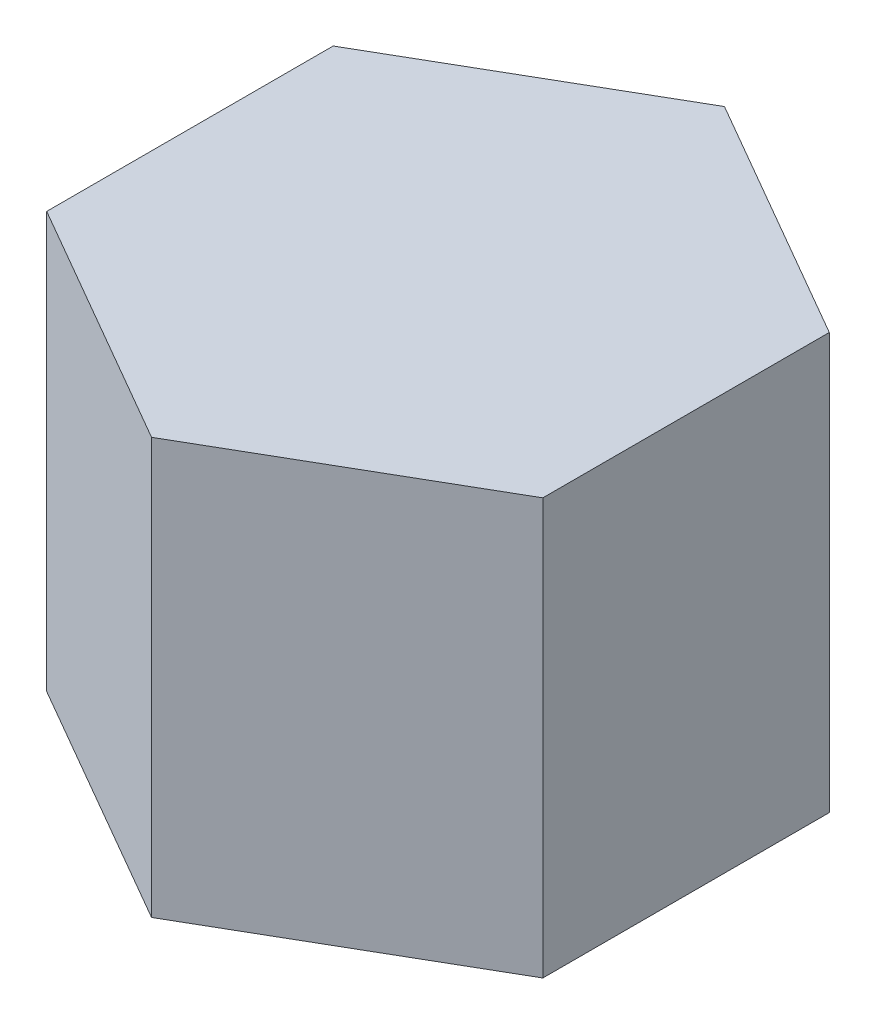
ISO-10303-21;
HEADER;
FILE_DESCRIPTION(('STEP AP214'),'2;1');
FILE_NAME('part.step','',(''),(''),'','','');
FILE_SCHEMA(('AUTOMOTIVE_DESIGN { 1 0 10303 214 1 1 1 1 }'));
ENDSEC;
DATA;
#1=APPLICATION_CONTEXT('core data for automotive mechanical design processes');
#2=APPLICATION_PROTOCOL_DEFINITION('international standard','automotive_design',2000,#1);
#3=PRODUCT_CONTEXT('',#1,'mechanical');
#4=PRODUCT('Part','Part','',(#3));
#5=PRODUCT_RELATED_PRODUCT_CATEGORY('part','',(#4));
#6=PRODUCT_DEFINITION_FORMATION('','',#4);
#7=PRODUCT_DEFINITION_CONTEXT('part definition',#1,'design');
#8=PRODUCT_DEFINITION('design','',#6,#7);
#9=PRODUCT_DEFINITION_SHAPE('','',#8);
#10=(LENGTH_UNIT() NAMED_UNIT(*) SI_UNIT(.MILLI.,.METRE.));
#11=(NAMED_UNIT(*) PLANE_ANGLE_UNIT() SI_UNIT($,.RADIAN.));
#12=(NAMED_UNIT(*) SI_UNIT($,.STERADIAN.) SOLID_ANGLE_UNIT());
#13=UNCERTAINTY_MEASURE_WITH_UNIT(LENGTH_MEASURE(1.E-05),#10,'distance_accuracy_value','');
#14=(GEOMETRIC_REPRESENTATION_CONTEXT(3) GLOBAL_UNCERTAINTY_ASSIGNED_CONTEXT((#13)) GLOBAL_UNIT_ASSIGNED_CONTEXT((#10,
#11,#12)) REPRESENTATION_CONTEXT('',''));
#15=CARTESIAN_POINT('',(0.,0.,0.));
#16=DIRECTION('',(0.,0.,1.));
#17=DIRECTION('',(1.,0.,0.));
#18=AXIS2_PLACEMENT_3D('',#15,#16,#17);
#19=CARTESIAN_POINT('',(206.642660308706,-148.537700895744,294.971072835632));
#20=DIRECTION('',(-0.499999999999909,0.,-0.866025403784491));
#21=DIRECTION('',(-0.866025403784491,0.,0.499999999999909));
#22=AXIS2_PLACEMENT_3D('',#19,#20,#21);
#23=PLANE('',#22);
#24=CARTESIAN_POINT('',(206.339551417381,-149.045793579175,295.146072835632));
#25=DIRECTION('',(0.866025403784491,0.,-0.499999999999909));
#26=VECTOR('',#25,1.);
#27=LINE('',#24,#26);
#28=CARTESIAN_POINT('',(206.339551417382,-149.045793579175,295.146072835632));
#29=VERTEX_POINT('',#28);
#30=CARTESIAN_POINT('',(206.642660308706,-149.045793579175,294.971072835632));
#31=VERTEX_POINT('',#30);
#32=EDGE_CURVE('E170',#29,#31,#27,.T.);
#33=ORIENTED_EDGE('',*,*,#32,.T.);
#34=CARTESIAN_POINT('',(206.642660308706,-148.537700895744,294.971072835632));
#35=DIRECTION('',(0.,-1.,0.));
#36=VECTOR('',#35,1.);
#37=LINE('',#34,#36);
#38=CARTESIAN_POINT('',(206.642660308706,-148.537700895744,294.971072835632));
#39=VERTEX_POINT('',#38);
#40=EDGE_CURVE('E35',#39,#31,#37,.T.);
#41=ORIENTED_EDGE('',*,*,#40,.F.);
#42=CARTESIAN_POINT('',(206.339551417381,-148.537700895744,295.146072835632));
#43=DIRECTION('',(0.866025403784491,0.,-0.499999999999909));
#44=VECTOR('',#43,1.);
#45=LINE('',#42,#44);
#46=CARTESIAN_POINT('',(206.339551417382,-148.537700895744,295.146072835632));
#47=VERTEX_POINT('',#46);
#48=EDGE_CURVE('E159',#47,#39,#45,.T.);
#49=ORIENTED_EDGE('',*,*,#48,.F.);
#50=CARTESIAN_POINT('',(206.339551417381,-148.537700895744,295.146072835632));
#51=DIRECTION('',(0.,-1.,0.));
#52=VECTOR('',#51,1.);
#53=LINE('',#50,#52);
#54=EDGE_CURVE('E10',#47,#29,#53,.T.);
#55=ORIENTED_EDGE('',*,*,#54,.T.);
#56=EDGE_LOOP('',(#33,#41,#49,#55));
#57=FACE_BOUND('',#56,.T.);
#58=ADVANCED_FACE('F16',(#57),#23,.F.);
#59=CARTESIAN_POINT('',(206.339551417382,-148.537700895744,295.146072835632));
#60=DIRECTION('',(0.500000000000062,0.,-0.866025403784403));
#61=DIRECTION('',(-0.866025403784403,0.,-0.500000000000062));
#62=AXIS2_PLACEMENT_3D('',#59,#60,#61);
#63=PLANE('',#62);
#64=CARTESIAN_POINT('',(206.036442526057,-149.045793579175,294.971072835632));
#65=DIRECTION('',(0.866025403784403,0.,0.500000000000062));
#66=VECTOR('',#65,1.);
#67=LINE('',#64,#66);
#68=CARTESIAN_POINT('',(206.036442526057,-149.045793579175,294.971072835632));
#69=VERTEX_POINT('',#68);
#70=EDGE_CURVE('E167',#69,#29,#67,.T.);
#71=ORIENTED_EDGE('',*,*,#70,.T.);
#72=ORIENTED_EDGE('',*,*,#54,.F.);
#73=CARTESIAN_POINT('',(206.036442526057,-148.537700895744,294.971072835632));
#74=DIRECTION('',(0.866025403784403,0.,0.500000000000062));
#75=VECTOR('',#74,1.);
#76=LINE('',#73,#75);
#77=CARTESIAN_POINT('',(206.036442526057,-148.537700895744,294.971072835632));
#78=VERTEX_POINT('',#77);
#79=EDGE_CURVE('E156',#78,#47,#76,.T.);
#80=ORIENTED_EDGE('',*,*,#79,.F.);
#81=CARTESIAN_POINT('',(206.036442526057,-148.537700895744,294.971072835632));
#82=DIRECTION('',(0.,-1.,0.));
#83=VECTOR('',#82,1.);
#84=LINE('',#81,#83);
#85=EDGE_CURVE('E27',#78,#69,#84,.T.);
#86=ORIENTED_EDGE('',*,*,#85,.T.);
#87=EDGE_LOOP('',(#71,#72,#80,#86));
#88=FACE_BOUND('',#87,.T.);
#89=ADVANCED_FACE('F189',(#88),#63,.F.);
#90=CARTESIAN_POINT('',(206.036442526057,-148.537700895744,290.831971220494));
#91=DIRECTION('',(1.,0.,0.));
#92=DIRECTION('',(0.,1.,0.));
#93=AXIS2_PLACEMENT_3D('',#90,#91,#92);
#94=PLANE('',#93);
#95=CARTESIAN_POINT('',(206.036442526057,-149.045793579175,294.621072835632));
#96=DIRECTION('',(0.,0.,1.));
#97=VECTOR('',#96,1.);
#98=LINE('',#95,#97);
#99=CARTESIAN_POINT('',(206.036442526057,-149.045793579175,294.621072835632));
#100=VERTEX_POINT('',#99);
#101=EDGE_CURVE('E163',#100,#69,#98,.T.);
#102=ORIENTED_EDGE('',*,*,#101,.T.);
#103=ORIENTED_EDGE('',*,*,#85,.F.);
#104=CARTESIAN_POINT('',(206.036442526057,-148.537700895744,294.621072835632));
#105=DIRECTION('',(0.,0.,1.));
#106=VECTOR('',#105,1.);
#107=LINE('',#104,#106);
#108=CARTESIAN_POINT('',(206.036442526057,-148.537700895744,294.621072835632));
#109=VERTEX_POINT('',#108);
#110=EDGE_CURVE('E106',#109,#78,#107,.T.);
#111=ORIENTED_EDGE('',*,*,#110,.F.);
#112=CARTESIAN_POINT('',(206.036442526057,-148.537700895744,294.621072835632));
#113=DIRECTION('',(0.,-1.,0.));
#114=VECTOR('',#113,1.);
#115=LINE('',#112,#114);
#116=EDGE_CURVE('E94',#109,#100,#115,.T.);
#117=ORIENTED_EDGE('',*,*,#116,.T.);
#118=EDGE_LOOP('',(#102,#103,#111,#117));
#119=FACE_BOUND('',#118,.T.);
#120=ADVANCED_FACE('F198',(#119),#94,.F.);
#121=CARTESIAN_POINT('',(206.036442526057,-148.537700895744,294.621072835632));
#122=DIRECTION('',(0.499999999999978,0.,0.866025403784452));
#123=DIRECTION('',(0.866025403784452,0.,-0.499999999999978));
#124=AXIS2_PLACEMENT_3D('',#121,#122,#123);
#125=PLANE('',#124);
#126=CARTESIAN_POINT('',(206.339551417382,-149.045793579175,294.446072835632));
#127=DIRECTION('',(-0.866025403784452,0.,0.499999999999978));
#128=VECTOR('',#127,1.);
#129=LINE('',#126,#128);
#130=CARTESIAN_POINT('',(206.339551417382,-149.045793579175,294.446072835632));
#131=VERTEX_POINT('',#130);
#132=EDGE_CURVE('E162',#131,#100,#129,.T.);
#133=ORIENTED_EDGE('',*,*,#132,.T.);
#134=ORIENTED_EDGE('',*,*,#116,.F.);
#135=CARTESIAN_POINT('',(206.339551417382,-148.537700895744,294.446072835632));
#136=DIRECTION('',(-0.866025403784452,0.,0.499999999999978));
#137=VECTOR('',#136,1.);
#138=LINE('',#135,#137);
#139=CARTESIAN_POINT('',(206.339551417382,-148.537700895744,294.446072835632));
#140=VERTEX_POINT('',#139);
#141=EDGE_CURVE('E98',#140,#109,#138,.T.);
#142=ORIENTED_EDGE('',*,*,#141,.F.);
#143=CARTESIAN_POINT('',(206.339551417382,-148.537700895744,294.446072835632));
#144=DIRECTION('',(0.,-1.,0.));
#145=VECTOR('',#144,1.);
#146=LINE('',#143,#145);
#147=EDGE_CURVE('E79',#140,#131,#146,.T.);
#148=ORIENTED_EDGE('',*,*,#147,.T.);
#149=EDGE_LOOP('',(#133,#134,#142,#148));
#150=FACE_BOUND('',#149,.T.);
#151=ADVANCED_FACE('F100',(#150),#125,.F.);
#152=CARTESIAN_POINT('',(206.339551417382,-148.537700895744,294.446072835632));
#153=DIRECTION('',(-0.500000000000012,0.,0.866025403784432));
#154=DIRECTION('',(0.866025403784432,0.,0.500000000000012));
#155=AXIS2_PLACEMENT_3D('',#152,#153,#154);
#156=PLANE('',#155);
#157=CARTESIAN_POINT('',(206.642660308706,-149.045793579175,294.621072835632));
#158=DIRECTION('',(-0.866025403784432,0.,-0.500000000000012));
#159=VECTOR('',#158,1.);
#160=LINE('',#157,#159);
#161=CARTESIAN_POINT('',(206.642660308706,-149.045793579175,294.621072835632));
#162=VERTEX_POINT('',#161);
#163=EDGE_CURVE('E88',#162,#131,#160,.T.);
#164=ORIENTED_EDGE('',*,*,#163,.T.);
#165=ORIENTED_EDGE('',*,*,#147,.F.);
#166=CARTESIAN_POINT('',(206.642660308706,-148.537700895744,294.621072835632));
#167=DIRECTION('',(-0.866025403784432,0.,-0.500000000000012));
#168=VECTOR('',#167,1.);
#169=LINE('',#166,#168);
#170=CARTESIAN_POINT('',(206.642660308706,-148.537700895744,294.621072835632));
#171=VERTEX_POINT('',#170);
#172=EDGE_CURVE('E84',#171,#140,#169,.T.);
#173=ORIENTED_EDGE('',*,*,#172,.F.);
#174=CARTESIAN_POINT('',(206.642660308706,-148.537700895744,294.621072835632));
#175=DIRECTION('',(0.,-1.,0.));
#176=VECTOR('',#175,1.);
#177=LINE('',#174,#176);
#178=EDGE_CURVE('E58',#171,#162,#177,.T.);
#179=ORIENTED_EDGE('',*,*,#178,.T.);
#180=EDGE_LOOP('',(#164,#165,#173,#179));
#181=FACE_BOUND('',#180,.T.);
#182=ADVANCED_FACE('F82',(#181),#156,.F.);
#183=CARTESIAN_POINT('',(206.642660308706,-148.537700895744,290.831971220494));
#184=DIRECTION('',(-1.,0.,0.));
#185=DIRECTION('',(0.,-1.,0.));
#186=AXIS2_PLACEMENT_3D('',#183,#184,#185);
#187=PLANE('',#186);
#188=CARTESIAN_POINT('',(206.642660308706,-149.045793579175,294.971072835632));
#189=DIRECTION('',(0.,0.,-1.));
#190=VECTOR('',#189,1.);
#191=LINE('',#188,#190);
#192=EDGE_CURVE('E160',#31,#162,#191,.T.);
#193=ORIENTED_EDGE('',*,*,#192,.T.);
#194=ORIENTED_EDGE('',*,*,#178,.F.);
#195=CARTESIAN_POINT('',(206.642660308706,-148.537700895744,294.971072835632));
#196=DIRECTION('',(0.,0.,-1.));
#197=VECTOR('',#196,1.);
#198=LINE('',#195,#197);
#199=EDGE_CURVE('E112',#39,#171,#198,.T.);
#200=ORIENTED_EDGE('',*,*,#199,.F.);
#201=ORIENTED_EDGE('',*,*,#40,.T.);
#202=EDGE_LOOP('',(#193,#194,#200,#201));
#203=FACE_BOUND('',#202,.T.);
#204=ADVANCED_FACE('F131',(#203),#187,.F.);
#205=CARTESIAN_POINT('',(206.339551417382,-148.537700895744,290.831971220494));
#206=DIRECTION('',(0.,-1.,0.));
#207=DIRECTION('',(1.,0.,0.));
#208=AXIS2_PLACEMENT_3D('',#205,#206,#207);
#209=PLANE('',#208);
#210=ORIENTED_EDGE('',*,*,#48,.T.);
#211=ORIENTED_EDGE('',*,*,#199,.T.);
#212=ORIENTED_EDGE('',*,*,#172,.T.);
#213=ORIENTED_EDGE('',*,*,#141,.T.);
#214=ORIENTED_EDGE('',*,*,#110,.T.);
#215=ORIENTED_EDGE('',*,*,#79,.T.);
#216=EDGE_LOOP('',(#210,#211,#212,#213,#214,#215));
#217=FACE_BOUND('',#216,.T.);
#218=ADVANCED_FACE('F111',(#217),#209,.F.);
#219=CARTESIAN_POINT('',(206.339551417382,-149.045793579175,290.831971220494));
#220=DIRECTION('',(0.,-1.,0.));
#221=DIRECTION('',(1.,0.,0.));
#222=AXIS2_PLACEMENT_3D('',#219,#220,#221);
#223=PLANE('',#222);
#224=ORIENTED_EDGE('',*,*,#32,.F.);
#225=ORIENTED_EDGE('',*,*,#70,.F.);
#226=ORIENTED_EDGE('',*,*,#101,.F.);
#227=ORIENTED_EDGE('',*,*,#132,.F.);
#228=ORIENTED_EDGE('',*,*,#163,.F.);
#229=ORIENTED_EDGE('',*,*,#192,.F.);
#230=EDGE_LOOP('',(#224,#225,#226,#227,#228,#229));
#231=FACE_BOUND('',#230,.T.);
#232=ADVANCED_FACE('F130',(#231),#223,.T.);
#233=CLOSED_SHELL('',(#58,#89,#120,#151,#182,#204,#218,#232));
#234=MANIFOLD_SOLID_BREP('B1',#233);
#235=ADVANCED_BREP_SHAPE_REPRESENTATION('',(#18,#234),#14);
#236=SHAPE_DEFINITION_REPRESENTATION(#9,#235);
ENDSEC;
END-ISO-10303-21;
